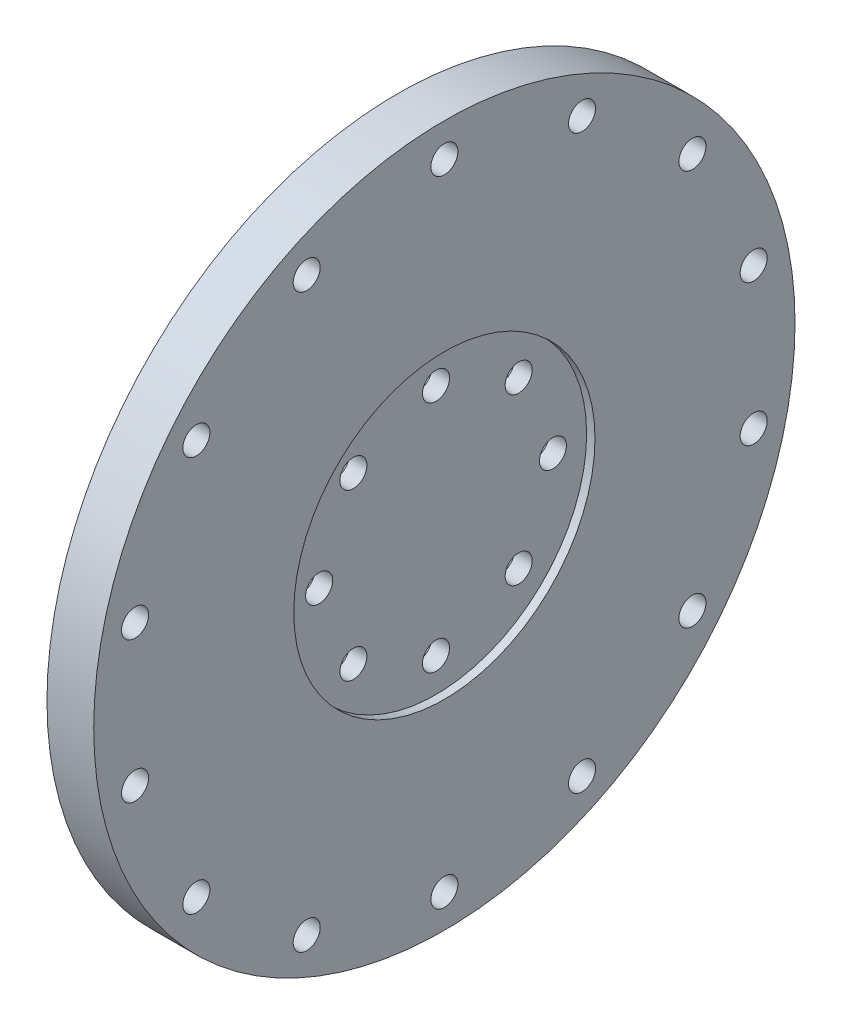
ISO-10303-21;
HEADER;
FILE_DESCRIPTION(('STEP AP214'),'2;1');
FILE_NAME('part.step','',(''),(''),'','','');
FILE_SCHEMA(('AUTOMOTIVE_DESIGN { 1 0 10303 214 1 1 1 1 }'));
ENDSEC;
DATA;
#1=APPLICATION_CONTEXT('core data for automotive mechanical design processes');
#2=APPLICATION_PROTOCOL_DEFINITION('international standard','automotive_design',2000,#1);
#3=PRODUCT_CONTEXT('',#1,'mechanical');
#4=PRODUCT('Part','Part','',(#3));
#5=PRODUCT_RELATED_PRODUCT_CATEGORY('part','',(#4));
#6=PRODUCT_DEFINITION_FORMATION('','',#4);
#7=PRODUCT_DEFINITION_CONTEXT('part definition',#1,'design');
#8=PRODUCT_DEFINITION('design','',#6,#7);
#9=PRODUCT_DEFINITION_SHAPE('','',#8);
#10=(LENGTH_UNIT() NAMED_UNIT(*) SI_UNIT(.MILLI.,.METRE.));
#11=(NAMED_UNIT(*) PLANE_ANGLE_UNIT() SI_UNIT($,.RADIAN.));
#12=(NAMED_UNIT(*) SI_UNIT($,.STERADIAN.) SOLID_ANGLE_UNIT());
#13=UNCERTAINTY_MEASURE_WITH_UNIT(LENGTH_MEASURE(1.E-05),#10,'distance_accuracy_value','');
#14=(GEOMETRIC_REPRESENTATION_CONTEXT(3) GLOBAL_UNCERTAINTY_ASSIGNED_CONTEXT((#13)) GLOBAL_UNIT_ASSIGNED_CONTEXT((#10,
#11,#12)) REPRESENTATION_CONTEXT('',''));
#15=CARTESIAN_POINT('',(0.,0.,0.));
#16=DIRECTION('',(0.,0.,1.));
#17=DIRECTION('',(1.,0.,0.));
#18=AXIS2_PLACEMENT_3D('',#15,#16,#17);
#19=CARTESIAN_POINT('',(-0.4,0.,17.5));
#20=DIRECTION('',(-1.,0.,0.));
#21=DIRECTION('',(0.,0.,1.));
#22=AXIS2_PLACEMENT_3D('',#19,#20,#21);
#23=CONICAL_SURFACE('',#22,2.025,0.785398163397448);
#24=CARTESIAN_POINT('',(-3.5,0.,17.5));
#25=DIRECTION('',(1.,0.,0.));
#26=DIRECTION('',(0.,0.,-1.));
#27=AXIS2_PLACEMENT_3D('',#24,#25,#26);
#28=CIRCLE('',#27,5.125);
#29=CARTESIAN_POINT('',(-3.5,0.,12.375));
#30=VERTEX_POINT('',#29);
#31=EDGE_CURVE('E196',#30,#30,#28,.T.);
#32=ORIENTED_EDGE('',*,*,#31,.F.);
#33=EDGE_LOOP('',(#32));
#34=FACE_BOUND('',#33,.T.);
#35=CARTESIAN_POINT('',(-0.4,0.,17.5));
#36=DIRECTION('',(1.,0.,0.));
#37=DIRECTION('',(0.,0.,-1.));
#38=AXIS2_PLACEMENT_3D('',#35,#36,#37);
#39=CIRCLE('',#38,2.025);
#40=CARTESIAN_POINT('',(-0.4,0.,15.475));
#41=VERTEX_POINT('',#40);
#42=EDGE_CURVE('E275',#41,#41,#39,.T.);
#43=ORIENTED_EDGE('',*,*,#42,.T.);
#44=EDGE_LOOP('',(#43));
#45=FACE_BOUND('',#44,.T.);
#46=ADVANCED_FACE('F16',(#34,#45),#23,.F.);
#47=CARTESIAN_POINT('',(-0.4,-12.3743686707646,12.3743686707646));
#48=DIRECTION('',(-1.,0.,0.));
#49=DIRECTION('',(0.,0.,1.));
#50=AXIS2_PLACEMENT_3D('',#47,#48,#49);
#51=CONICAL_SURFACE('',#50,2.025,0.785398163397448);
#52=CARTESIAN_POINT('',(-3.5,-12.3743686707646,12.3743686707646));
#53=DIRECTION('',(1.,0.,0.));
#54=DIRECTION('',(0.,0.,-1.));
#55=AXIS2_PLACEMENT_3D('',#52,#53,#54);
#56=CIRCLE('',#55,5.125);
#57=CARTESIAN_POINT('',(-3.5,-12.3743686707646,7.24936867076458));
#58=VERTEX_POINT('',#57);
#59=EDGE_CURVE('E270',#58,#58,#56,.T.);
#60=ORIENTED_EDGE('',*,*,#59,.F.);
#61=EDGE_LOOP('',(#60));
#62=FACE_BOUND('',#61,.T.);
#63=CARTESIAN_POINT('',(-0.4,-12.3743686707646,12.3743686707646));
#64=DIRECTION('',(1.,0.,0.));
#65=DIRECTION('',(0.,0.,-1.));
#66=AXIS2_PLACEMENT_3D('',#63,#64,#65);
#67=CIRCLE('',#66,2.025);
#68=CARTESIAN_POINT('',(-0.4,-12.3743686707646,10.3493686707646));
#69=VERTEX_POINT('',#68);
#70=EDGE_CURVE('E578',#69,#69,#67,.T.);
#71=ORIENTED_EDGE('',*,*,#70,.T.);
#72=EDGE_LOOP('',(#71));
#73=FACE_BOUND('',#72,.T.);
#74=ADVANCED_FACE('F386',(#62,#73),#51,.F.);
#75=CARTESIAN_POINT('',(-0.4,-17.5,0.));
#76=DIRECTION('',(-1.,0.,0.));
#77=DIRECTION('',(0.,0.,1.));
#78=AXIS2_PLACEMENT_3D('',#75,#76,#77);
#79=CONICAL_SURFACE('',#78,2.025,0.785398163397448);
#80=CARTESIAN_POINT('',(-3.5,-17.5,0.));
#81=DIRECTION('',(1.,0.,0.));
#82=DIRECTION('',(0.,0.,-1.));
#83=AXIS2_PLACEMENT_3D('',#80,#81,#82);
#84=CIRCLE('',#83,5.125);
#85=CARTESIAN_POINT('',(-3.5,-17.5,-5.125));
#86=VERTEX_POINT('',#85);
#87=EDGE_CURVE('E284',#86,#86,#84,.T.);
#88=ORIENTED_EDGE('',*,*,#87,.F.);
#89=EDGE_LOOP('',(#88));
#90=FACE_BOUND('',#89,.T.);
#91=CARTESIAN_POINT('',(-0.4,-17.5,0.));
#92=DIRECTION('',(1.,0.,0.));
#93=DIRECTION('',(0.,0.,-1.));
#94=AXIS2_PLACEMENT_3D('',#91,#92,#93);
#95=CIRCLE('',#94,2.025);
#96=CARTESIAN_POINT('',(-0.4,-17.5,-2.025));
#97=VERTEX_POINT('',#96);
#98=EDGE_CURVE('E563',#97,#97,#95,.T.);
#99=ORIENTED_EDGE('',*,*,#98,.T.);
#100=EDGE_LOOP('',(#99));
#101=FACE_BOUND('',#100,.T.);
#102=ADVANCED_FACE('F391',(#90,#101),#79,.F.);
#103=CARTESIAN_POINT('',(-0.4,-12.3743686707646,-12.3743686707646));
#104=DIRECTION('',(-1.,0.,0.));
#105=DIRECTION('',(0.,0.,1.));
#106=AXIS2_PLACEMENT_3D('',#103,#104,#105);
#107=CONICAL_SURFACE('',#106,2.025,0.785398163397448);
#108=CARTESIAN_POINT('',(-3.5,-12.3743686707646,-12.3743686707646));
#109=DIRECTION('',(1.,0.,0.));
#110=DIRECTION('',(0.,0.,-1.));
#111=AXIS2_PLACEMENT_3D('',#108,#109,#110);
#112=CIRCLE('',#111,5.125);
#113=CARTESIAN_POINT('',(-3.5,-12.3743686707646,-17.4993686707646));
#114=VERTEX_POINT('',#113);
#115=EDGE_CURVE('E288',#114,#114,#112,.T.);
#116=ORIENTED_EDGE('',*,*,#115,.F.);
#117=EDGE_LOOP('',(#116));
#118=FACE_BOUND('',#117,.T.);
#119=CARTESIAN_POINT('',(-0.4,-12.3743686707646,-12.3743686707646));
#120=DIRECTION('',(1.,0.,0.));
#121=DIRECTION('',(0.,0.,-1.));
#122=AXIS2_PLACEMENT_3D('',#119,#120,#121);
#123=CIRCLE('',#122,2.025);
#124=CARTESIAN_POINT('',(-0.4,-12.3743686707646,-14.3993686707646));
#125=VERTEX_POINT('',#124);
#126=EDGE_CURVE('E235',#125,#125,#123,.T.);
#127=ORIENTED_EDGE('',*,*,#126,.T.);
#128=EDGE_LOOP('',(#127));
#129=FACE_BOUND('',#128,.T.);
#130=ADVANCED_FACE('F540',(#118,#129),#107,.F.);
#131=CARTESIAN_POINT('',(-0.4,0.,-17.5));
#132=DIRECTION('',(-1.,0.,0.));
#133=DIRECTION('',(0.,0.,1.));
#134=AXIS2_PLACEMENT_3D('',#131,#132,#133);
#135=CONICAL_SURFACE('',#134,2.025,0.785398163397448);
#136=CARTESIAN_POINT('',(-3.5,0.,-17.5));
#137=DIRECTION('',(1.,0.,0.));
#138=DIRECTION('',(0.,0.,-1.));
#139=AXIS2_PLACEMENT_3D('',#136,#137,#138);
#140=CIRCLE('',#139,5.125);
#141=CARTESIAN_POINT('',(-3.5,0.,-22.625));
#142=VERTEX_POINT('',#141);
#143=EDGE_CURVE('E208',#142,#142,#140,.T.);
#144=ORIENTED_EDGE('',*,*,#143,.F.);
#145=EDGE_LOOP('',(#144));
#146=FACE_BOUND('',#145,.T.);
#147=CARTESIAN_POINT('',(-0.4,0.,-17.5));
#148=DIRECTION('',(1.,0.,0.));
#149=DIRECTION('',(0.,0.,-1.));
#150=AXIS2_PLACEMENT_3D('',#147,#148,#149);
#151=CIRCLE('',#150,2.025);
#152=CARTESIAN_POINT('',(-0.4,0.,-19.525));
#153=VERTEX_POINT('',#152);
#154=EDGE_CURVE('E250',#153,#153,#151,.T.);
#155=ORIENTED_EDGE('',*,*,#154,.T.);
#156=EDGE_LOOP('',(#155));
#157=FACE_BOUND('',#156,.T.);
#158=ADVANCED_FACE('F537',(#146,#157),#135,.F.);
#159=CARTESIAN_POINT('',(-0.4,12.3743686707646,-12.3743686707646));
#160=DIRECTION('',(-1.,0.,0.));
#161=DIRECTION('',(0.,0.,1.));
#162=AXIS2_PLACEMENT_3D('',#159,#160,#161);
#163=CONICAL_SURFACE('',#162,2.025,0.785398163397448);
#164=CARTESIAN_POINT('',(-3.5,12.3743686707646,-12.3743686707646));
#165=DIRECTION('',(1.,0.,0.));
#166=DIRECTION('',(0.,0.,-1.));
#167=AXIS2_PLACEMENT_3D('',#164,#165,#166);
#168=CIRCLE('',#167,5.125);
#169=CARTESIAN_POINT('',(-3.5,12.3743686707646,-17.4993686707646));
#170=VERTEX_POINT('',#169);
#171=EDGE_CURVE('E203',#170,#170,#168,.T.);
#172=ORIENTED_EDGE('',*,*,#171,.F.);
#173=EDGE_LOOP('',(#172));
#174=FACE_BOUND('',#173,.T.);
#175=CARTESIAN_POINT('',(-0.4,12.3743686707646,-12.3743686707646));
#176=DIRECTION('',(1.,0.,0.));
#177=DIRECTION('',(0.,0.,-1.));
#178=AXIS2_PLACEMENT_3D('',#175,#176,#177);
#179=CIRCLE('',#178,2.025);
#180=CARTESIAN_POINT('',(-0.4,12.3743686707646,-14.3993686707646));
#181=VERTEX_POINT('',#180);
#182=EDGE_CURVE('E249',#181,#181,#179,.T.);
#183=ORIENTED_EDGE('',*,*,#182,.T.);
#184=EDGE_LOOP('',(#183));
#185=FACE_BOUND('',#184,.T.);
#186=ADVANCED_FACE('F401',(#174,#185),#163,.F.);
#187=CARTESIAN_POINT('',(-0.4,12.3743686707646,12.3743686707646));
#188=DIRECTION('',(-1.,0.,0.));
#189=DIRECTION('',(0.,0.,1.));
#190=AXIS2_PLACEMENT_3D('',#187,#188,#189);
#191=CONICAL_SURFACE('',#190,2.025,0.785398163397448);
#192=CARTESIAN_POINT('',(-3.5,12.3743686707646,12.3743686707646));
#193=DIRECTION('',(1.,0.,0.));
#194=DIRECTION('',(0.,0.,-1.));
#195=AXIS2_PLACEMENT_3D('',#192,#193,#194);
#196=CIRCLE('',#195,5.125);
#197=CARTESIAN_POINT('',(-3.5,12.3743686707646,7.24936867076458));
#198=VERTEX_POINT('',#197);
#199=EDGE_CURVE('E207',#198,#198,#196,.T.);
#200=ORIENTED_EDGE('',*,*,#199,.F.);
#201=EDGE_LOOP('',(#200));
#202=FACE_BOUND('',#201,.T.);
#203=CARTESIAN_POINT('',(-0.4,12.3743686707646,12.3743686707646));
#204=DIRECTION('',(1.,0.,0.));
#205=DIRECTION('',(0.,0.,-1.));
#206=AXIS2_PLACEMENT_3D('',#203,#204,#205);
#207=CIRCLE('',#206,2.025);
#208=CARTESIAN_POINT('',(-0.4,12.3743686707646,10.3493686707646));
#209=VERTEX_POINT('',#208);
#210=EDGE_CURVE('E317',#209,#209,#207,.T.);
#211=ORIENTED_EDGE('',*,*,#210,.T.);
#212=EDGE_LOOP('',(#211));
#213=FACE_BOUND('',#212,.T.);
#214=ADVANCED_FACE('F397',(#202,#213),#191,.F.);
#215=CARTESIAN_POINT('',(-0.4,17.5,0.));
#216=DIRECTION('',(-1.,0.,0.));
#217=DIRECTION('',(0.,0.,1.));
#218=AXIS2_PLACEMENT_3D('',#215,#216,#217);
#219=CONICAL_SURFACE('',#218,2.025,0.785398163397448);
#220=CARTESIAN_POINT('',(-3.5,17.5,0.));
#221=DIRECTION('',(1.,0.,0.));
#222=DIRECTION('',(0.,0.,-1.));
#223=AXIS2_PLACEMENT_3D('',#220,#221,#222);
#224=CIRCLE('',#223,5.125);
#225=CARTESIAN_POINT('',(-3.5,17.5,-5.125));
#226=VERTEX_POINT('',#225);
#227=EDGE_CURVE('E27',#226,#226,#224,.T.);
#228=ORIENTED_EDGE('',*,*,#227,.F.);
#229=EDGE_LOOP('',(#228));
#230=FACE_BOUND('',#229,.T.);
#231=CARTESIAN_POINT('',(-0.4,17.5,0.));
#232=DIRECTION('',(1.,0.,0.));
#233=DIRECTION('',(0.,0.,-1.));
#234=AXIS2_PLACEMENT_3D('',#231,#232,#233);
#235=CIRCLE('',#234,2.025);
#236=CARTESIAN_POINT('',(-0.4,17.5,-2.025));
#237=VERTEX_POINT('',#236);
#238=EDGE_CURVE('E276',#237,#237,#235,.T.);
#239=ORIENTED_EDGE('',*,*,#238,.T.);
#240=EDGE_LOOP('',(#239));
#241=FACE_BOUND('',#240,.T.);
#242=ADVANCED_FACE('F382',(#230,#241),#219,.F.);
#243=CARTESIAN_POINT('',(2.25,0.,0.));
#244=DIRECTION('',(1.,0.,0.));
#245=DIRECTION('',(0.,1.,0.));
#246=AXIS2_PLACEMENT_3D('',#243,#244,#245);
#247=PLANE('',#246);
#248=CARTESIAN_POINT('',(2.25,0.,0.));
#249=DIRECTION('',(1.,0.,0.));
#250=DIRECTION('',(0.,0.,-1.));
#251=AXIS2_PLACEMENT_3D('',#248,#249,#250);
#252=CIRCLE('',#251,22.55);
#253=CARTESIAN_POINT('',(2.25,0.,-22.55));
#254=VERTEX_POINT('',#253);
#255=EDGE_CURVE('E11',#254,#254,#252,.T.);
#256=ORIENTED_EDGE('',*,*,#255,.T.);
#257=EDGE_LOOP('',(#256));
#258=FACE_BOUND('',#257,.T.);
#259=CARTESIAN_POINT('',(2.25,0.,17.5));
#260=DIRECTION('',(1.,0.,0.));
#261=DIRECTION('',(0.,0.,-1.));
#262=AXIS2_PLACEMENT_3D('',#259,#260,#261);
#263=CIRCLE('',#262,2.025);
#264=CARTESIAN_POINT('',(2.25,0.,15.475));
#265=VERTEX_POINT('',#264);
#266=EDGE_CURVE('E322',#265,#265,#263,.T.);
#267=ORIENTED_EDGE('',*,*,#266,.F.);
#268=EDGE_LOOP('',(#267));
#269=FACE_BOUND('',#268,.T.);
#270=CARTESIAN_POINT('',(2.25,-12.3743686707646,12.3743686707646));
#271=DIRECTION('',(1.,0.,0.));
#272=DIRECTION('',(0.,0.,-1.));
#273=AXIS2_PLACEMENT_3D('',#270,#271,#272);
#274=CIRCLE('',#273,2.025);
#275=CARTESIAN_POINT('',(2.25,-12.3743686707646,10.3493686707646));
#276=VERTEX_POINT('',#275);
#277=EDGE_CURVE('E421',#276,#276,#274,.T.);
#278=ORIENTED_EDGE('',*,*,#277,.F.);
#279=EDGE_LOOP('',(#278));
#280=FACE_BOUND('',#279,.T.);
#281=CARTESIAN_POINT('',(2.25,-17.5,0.));
#282=DIRECTION('',(1.,0.,0.));
#283=DIRECTION('',(0.,0.,-1.));
#284=AXIS2_PLACEMENT_3D('',#281,#282,#283);
#285=CIRCLE('',#284,2.025);
#286=CARTESIAN_POINT('',(2.25,-17.5,-2.025));
#287=VERTEX_POINT('',#286);
#288=EDGE_CURVE('E560',#287,#287,#285,.T.);
#289=ORIENTED_EDGE('',*,*,#288,.F.);
#290=EDGE_LOOP('',(#289));
#291=FACE_BOUND('',#290,.T.);
#292=CARTESIAN_POINT('',(2.25,-12.3743686707646,-12.3743686707646));
#293=DIRECTION('',(1.,0.,0.));
#294=DIRECTION('',(0.,0.,-1.));
#295=AXIS2_PLACEMENT_3D('',#292,#293,#294);
#296=CIRCLE('',#295,2.025);
#297=CARTESIAN_POINT('',(2.25,-12.3743686707646,-14.3993686707646));
#298=VERTEX_POINT('',#297);
#299=EDGE_CURVE('E260',#298,#298,#296,.T.);
#300=ORIENTED_EDGE('',*,*,#299,.F.);
#301=EDGE_LOOP('',(#300));
#302=FACE_BOUND('',#301,.T.);
#303=CARTESIAN_POINT('',(2.25,0.,-17.5));
#304=DIRECTION('',(1.,0.,0.));
#305=DIRECTION('',(0.,0.,-1.));
#306=AXIS2_PLACEMENT_3D('',#303,#304,#305);
#307=CIRCLE('',#306,2.025);
#308=CARTESIAN_POINT('',(2.25,0.,-19.525));
#309=VERTEX_POINT('',#308);
#310=EDGE_CURVE('E246',#309,#309,#307,.T.);
#311=ORIENTED_EDGE('',*,*,#310,.F.);
#312=EDGE_LOOP('',(#311));
#313=FACE_BOUND('',#312,.T.);
#314=CARTESIAN_POINT('',(2.25,12.3743686707646,-12.3743686707646));
#315=DIRECTION('',(1.,0.,0.));
#316=DIRECTION('',(0.,0.,-1.));
#317=AXIS2_PLACEMENT_3D('',#314,#315,#316);
#318=CIRCLE('',#317,2.025);
#319=CARTESIAN_POINT('',(2.25,12.3743686707646,-14.3993686707646));
#320=VERTEX_POINT('',#319);
#321=EDGE_CURVE('E258',#320,#320,#318,.T.);
#322=ORIENTED_EDGE('',*,*,#321,.F.);
#323=EDGE_LOOP('',(#322));
#324=FACE_BOUND('',#323,.T.);
#325=CARTESIAN_POINT('',(2.25,12.3743686707646,12.3743686707646));
#326=DIRECTION('',(1.,0.,0.));
#327=DIRECTION('',(0.,0.,-1.));
#328=AXIS2_PLACEMENT_3D('',#325,#326,#327);
#329=CIRCLE('',#328,2.025);
#330=CARTESIAN_POINT('',(2.25,12.3743686707646,10.3493686707646));
#331=VERTEX_POINT('',#330);
#332=EDGE_CURVE('E413',#331,#331,#329,.T.);
#333=ORIENTED_EDGE('',*,*,#332,.F.);
#334=EDGE_LOOP('',(#333));
#335=FACE_BOUND('',#334,.T.);
#336=CARTESIAN_POINT('',(2.25,17.5,0.));
#337=DIRECTION('',(1.,0.,0.));
#338=DIRECTION('',(0.,0.,-1.));
#339=AXIS2_PLACEMENT_3D('',#336,#337,#338);
#340=CIRCLE('',#339,2.025);
#341=CARTESIAN_POINT('',(2.25,17.5,-2.025));
#342=VERTEX_POINT('',#341);
#343=EDGE_CURVE('E272',#342,#342,#340,.T.);
#344=ORIENTED_EDGE('',*,*,#343,.F.);
#345=EDGE_LOOP('',(#344));
#346=FACE_BOUND('',#345,.T.);
#347=ADVANCED_FACE('F374',(#258,#269,#280,#291,#302,#313,#324,#335,#346),#247,.T.);
#348=CARTESIAN_POINT('',(2.25,0.,0.));
#349=DIRECTION('',(1.,0.,0.));
#350=DIRECTION('',(0.,0.,-1.));
#351=AXIS2_PLACEMENT_3D('',#348,#349,#350);
#352=CYLINDRICAL_SURFACE('',#351,22.55);
#353=CARTESIAN_POINT('',(3.5,0.,0.));
#354=DIRECTION('',(1.,0.,0.));
#355=DIRECTION('',(0.,0.,-1.));
#356=AXIS2_PLACEMENT_3D('',#353,#354,#355);
#357=CIRCLE('',#356,22.55);
#358=CARTESIAN_POINT('',(3.5,0.,-22.55));
#359=VERTEX_POINT('',#358);
#360=EDGE_CURVE('E289',#359,#359,#357,.T.);
#361=ORIENTED_EDGE('',*,*,#360,.T.);
#362=EDGE_LOOP('',(#361));
#363=FACE_BOUND('',#362,.T.);
#364=ORIENTED_EDGE('',*,*,#255,.F.);
#365=EDGE_LOOP('',(#364));
#366=FACE_BOUND('',#365,.T.);
#367=ADVANCED_FACE('F371',(#363,#366),#352,.F.);
#368=CARTESIAN_POINT('',(-3.5,0.,0.));
#369=DIRECTION('',(1.,0.,0.));
#370=DIRECTION('',(0.,1.,0.));
#371=AXIS2_PLACEMENT_3D('',#368,#369,#370);
#372=PLANE('',#371);
#373=CARTESIAN_POINT('',(-3.5,0.,0.));
#374=DIRECTION('',(1.,0.,0.));
#375=DIRECTION('',(0.,0.,-1.));
#376=AXIS2_PLACEMENT_3D('',#373,#374,#375);
#377=CIRCLE('',#376,52.5);
#378=CARTESIAN_POINT('',(-3.5,0.,-52.5));
#379=VERTEX_POINT('',#378);
#380=EDGE_CURVE('E428',#379,#379,#377,.T.);
#381=ORIENTED_EDGE('',*,*,#380,.F.);
#382=EDGE_LOOP('',(#381));
#383=FACE_BOUND('',#382,.T.);
#384=CARTESIAN_POINT('',(-3.5,-10.5697443629249,46.3090758286366));
#385=DIRECTION('',(1.,0.,0.));
#386=DIRECTION('',(0.,0.,-1.));
#387=AXIS2_PLACEMENT_3D('',#384,#385,#386);
#388=CIRCLE('',#387,2.025);
#389=CARTESIAN_POINT('',(-3.5,-10.5697443629249,44.2840758286366));
#390=VERTEX_POINT('',#389);
#391=EDGE_CURVE('E300',#390,#390,#388,.T.);
#392=ORIENTED_EDGE('',*,*,#391,.T.);
#393=EDGE_LOOP('',(#392));
#394=FACE_BOUND('',#393,.T.);
#395=CARTESIAN_POINT('',(-3.5,-29.6157655882898,37.1369954172314));
#396=DIRECTION('',(1.,0.,0.));
#397=DIRECTION('',(0.,0.,-1.));
#398=AXIS2_PLACEMENT_3D('',#395,#396,#397);
#399=CIRCLE('',#398,2.025);
#400=CARTESIAN_POINT('',(-3.5,-29.6157655882898,35.1119954172314));
#401=VERTEX_POINT('',#400);
#402=EDGE_CURVE('E198',#401,#401,#399,.T.);
#403=ORIENTED_EDGE('',*,*,#402,.T.);
#404=EDGE_LOOP('',(#403));
#405=FACE_BOUND('',#404,.T.);
#406=CARTESIAN_POINT('',(-3.5,-42.7960212253649,20.609477608084));
#407=DIRECTION('',(1.,0.,0.));
#408=DIRECTION('',(0.,0.,-1.));
#409=AXIS2_PLACEMENT_3D('',#406,#407,#408);
#410=CIRCLE('',#409,2.025);
#411=CARTESIAN_POINT('',(-3.5,-42.7960212253649,18.584477608084));
#412=VERTEX_POINT('',#411);
#413=EDGE_CURVE('E209',#412,#412,#410,.T.);
#414=ORIENTED_EDGE('',*,*,#413,.T.);
#415=EDGE_LOOP('',(#414));
#416=FACE_BOUND('',#415,.T.);
#417=CARTESIAN_POINT('',(-3.5,-47.5,0.));
#418=DIRECTION('',(1.,0.,0.));
#419=DIRECTION('',(0.,0.,-1.));
#420=AXIS2_PLACEMENT_3D('',#417,#418,#419);
#421=CIRCLE('',#420,2.025);
#422=CARTESIAN_POINT('',(-3.5,-47.5,-2.025));
#423=VERTEX_POINT('',#422);
#424=EDGE_CURVE('E311',#423,#423,#421,.T.);
#425=ORIENTED_EDGE('',*,*,#424,.T.);
#426=EDGE_LOOP('',(#425));
#427=FACE_BOUND('',#426,.T.);
#428=CARTESIAN_POINT('',(-3.5,-42.7960212253649,-20.609477608084));
#429=DIRECTION('',(1.,0.,0.));
#430=DIRECTION('',(0.,0.,-1.));
#431=AXIS2_PLACEMENT_3D('',#428,#429,#430);
#432=CIRCLE('',#431,2.025);
#433=CARTESIAN_POINT('',(-3.5,-42.7960212253649,-22.634477608084));
#434=VERTEX_POINT('',#433);
#435=EDGE_CURVE('E303',#434,#434,#432,.T.);
#436=ORIENTED_EDGE('',*,*,#435,.T.);
#437=EDGE_LOOP('',(#436));
#438=FACE_BOUND('',#437,.T.);
#439=CARTESIAN_POINT('',(-3.5,-29.6157655882898,-37.1369954172314));
#440=DIRECTION('',(1.,0.,0.));
#441=DIRECTION('',(0.,0.,-1.));
#442=AXIS2_PLACEMENT_3D('',#439,#440,#441);
#443=CIRCLE('',#442,2.025);
#444=CARTESIAN_POINT('',(-3.5,-29.6157655882898,-39.1619954172314));
#445=VERTEX_POINT('',#444);
#446=EDGE_CURVE('E20',#445,#445,#443,.T.);
#447=ORIENTED_EDGE('',*,*,#446,.T.);
#448=EDGE_LOOP('',(#447));
#449=FACE_BOUND('',#448,.T.);
#450=CARTESIAN_POINT('',(-3.5,-10.5697443629249,-46.3090758286366));
#451=DIRECTION('',(1.,0.,0.));
#452=DIRECTION('',(0.,0.,-1.));
#453=AXIS2_PLACEMENT_3D('',#450,#451,#452);
#454=CIRCLE('',#453,2.025);
#455=CARTESIAN_POINT('',(-3.5,-10.5697443629249,-48.3340758286366));
#456=VERTEX_POINT('',#455);
#457=EDGE_CURVE('E278',#456,#456,#454,.T.);
#458=ORIENTED_EDGE('',*,*,#457,.T.);
#459=EDGE_LOOP('',(#458));
#460=FACE_BOUND('',#459,.T.);
#461=CARTESIAN_POINT('',(-3.5,10.5697443629249,-46.3090758286366));
#462=DIRECTION('',(1.,0.,0.));
#463=DIRECTION('',(0.,0.,-1.));
#464=AXIS2_PLACEMENT_3D('',#461,#462,#463);
#465=CIRCLE('',#464,2.025);
#466=CARTESIAN_POINT('',(-3.5,10.5697443629249,-48.3340758286366));
#467=VERTEX_POINT('',#466);
#468=EDGE_CURVE('E241',#467,#467,#465,.T.);
#469=ORIENTED_EDGE('',*,*,#468,.T.);
#470=EDGE_LOOP('',(#469));
#471=FACE_BOUND('',#470,.T.);
#472=CARTESIAN_POINT('',(-3.5,29.6157655882898,-37.1369954172314));
#473=DIRECTION('',(1.,0.,0.));
#474=DIRECTION('',(0.,0.,-1.));
#475=AXIS2_PLACEMENT_3D('',#472,#473,#474);
#476=CIRCLE('',#475,2.025);
#477=CARTESIAN_POINT('',(-3.5,29.6157655882898,-39.1619954172314));
#478=VERTEX_POINT('',#477);
#479=EDGE_CURVE('E224',#478,#478,#476,.T.);
#480=ORIENTED_EDGE('',*,*,#479,.T.);
#481=EDGE_LOOP('',(#480));
#482=FACE_BOUND('',#481,.T.);
#483=CARTESIAN_POINT('',(-3.5,42.7960212253649,-20.609477608084));
#484=DIRECTION('',(1.,0.,0.));
#485=DIRECTION('',(0.,0.,-1.));
#486=AXIS2_PLACEMENT_3D('',#483,#484,#485);
#487=CIRCLE('',#486,2.025);
#488=CARTESIAN_POINT('',(-3.5,42.7960212253649,-22.634477608084));
#489=VERTEX_POINT('',#488);
#490=EDGE_CURVE('E213',#489,#489,#487,.T.);
#491=ORIENTED_EDGE('',*,*,#490,.T.);
#492=EDGE_LOOP('',(#491));
#493=FACE_BOUND('',#492,.T.);
#494=CARTESIAN_POINT('',(-3.5,47.5,0.));
#495=DIRECTION('',(1.,0.,0.));
#496=DIRECTION('',(0.,0.,-1.));
#497=AXIS2_PLACEMENT_3D('',#494,#495,#496);
#498=CIRCLE('',#497,2.025);
#499=CARTESIAN_POINT('',(-3.5,47.5,-2.025));
#500=VERTEX_POINT('',#499);
#501=EDGE_CURVE('E172',#500,#500,#498,.T.);
#502=ORIENTED_EDGE('',*,*,#501,.T.);
#503=EDGE_LOOP('',(#502));
#504=FACE_BOUND('',#503,.T.);
#505=CARTESIAN_POINT('',(-3.5,42.7960212253649,20.609477608084));
#506=DIRECTION('',(1.,0.,0.));
#507=DIRECTION('',(0.,0.,-1.));
#508=AXIS2_PLACEMENT_3D('',#505,#506,#507);
#509=CIRCLE('',#508,2.025);
#510=CARTESIAN_POINT('',(-3.5,42.7960212253649,18.584477608084));
#511=VERTEX_POINT('',#510);
#512=EDGE_CURVE('E182',#511,#511,#509,.T.);
#513=ORIENTED_EDGE('',*,*,#512,.T.);
#514=EDGE_LOOP('',(#513));
#515=FACE_BOUND('',#514,.T.);
#516=CARTESIAN_POINT('',(-3.5,29.6157655882898,37.1369954172314));
#517=DIRECTION('',(1.,0.,0.));
#518=DIRECTION('',(0.,0.,-1.));
#519=AXIS2_PLACEMENT_3D('',#516,#517,#518);
#520=CIRCLE('',#519,2.025);
#521=CARTESIAN_POINT('',(-3.5,29.6157655882898,35.1119954172314));
#522=VERTEX_POINT('',#521);
#523=EDGE_CURVE('E245',#522,#522,#520,.T.);
#524=ORIENTED_EDGE('',*,*,#523,.T.);
#525=EDGE_LOOP('',(#524));
#526=FACE_BOUND('',#525,.T.);
#527=CARTESIAN_POINT('',(-3.5,10.5697443629249,46.3090758286366));
#528=DIRECTION('',(1.,0.,0.));
#529=DIRECTION('',(0.,0.,-1.));
#530=AXIS2_PLACEMENT_3D('',#527,#528,#529);
#531=CIRCLE('',#530,2.025);
#532=CARTESIAN_POINT('',(-3.5,10.5697443629249,44.2840758286366));
#533=VERTEX_POINT('',#532);
#534=EDGE_CURVE('E244',#533,#533,#531,.T.);
#535=ORIENTED_EDGE('',*,*,#534,.T.);
#536=EDGE_LOOP('',(#535));
#537=FACE_BOUND('',#536,.T.);
#538=ORIENTED_EDGE('',*,*,#227,.T.);
#539=EDGE_LOOP('',(#538));
#540=FACE_BOUND('',#539,.T.);
#541=ORIENTED_EDGE('',*,*,#199,.T.);
#542=EDGE_LOOP('',(#541));
#543=FACE_BOUND('',#542,.T.);
#544=ORIENTED_EDGE('',*,*,#171,.T.);
#545=EDGE_LOOP('',(#544));
#546=FACE_BOUND('',#545,.T.);
#547=ORIENTED_EDGE('',*,*,#143,.T.);
#548=EDGE_LOOP('',(#547));
#549=FACE_BOUND('',#548,.T.);
#550=ORIENTED_EDGE('',*,*,#115,.T.);
#551=EDGE_LOOP('',(#550));
#552=FACE_BOUND('',#551,.T.);
#553=ORIENTED_EDGE('',*,*,#87,.T.);
#554=EDGE_LOOP('',(#553));
#555=FACE_BOUND('',#554,.T.);
#556=ORIENTED_EDGE('',*,*,#59,.T.);
#557=EDGE_LOOP('',(#556));
#558=FACE_BOUND('',#557,.T.);
#559=ORIENTED_EDGE('',*,*,#31,.T.);
#560=EDGE_LOOP('',(#559));
#561=FACE_BOUND('',#560,.T.);
#562=ADVANCED_FACE('F331',(#383,#394,#405,#416,#427,#438,#449,#460,#471,#482,#493,#504,#515,
#526,#537,#540,#543,#546,#549,#552,#555,#558,#561),#372,.F.);
#563=CARTESIAN_POINT('',(3.5,0.,0.));
#564=DIRECTION('',(1.,0.,0.));
#565=DIRECTION('',(0.,1.,0.));
#566=AXIS2_PLACEMENT_3D('',#563,#564,#565);
#567=PLANE('',#566);
#568=CARTESIAN_POINT('',(3.5,0.,0.));
#569=DIRECTION('',(1.,0.,0.));
#570=DIRECTION('',(0.,0.,-1.));
#571=AXIS2_PLACEMENT_3D('',#568,#569,#570);
#572=CIRCLE('',#571,52.5);
#573=CARTESIAN_POINT('',(3.5,0.,-52.5));
#574=VERTEX_POINT('',#573);
#575=EDGE_CURVE('E324',#574,#574,#572,.T.);
#576=ORIENTED_EDGE('',*,*,#575,.T.);
#577=EDGE_LOOP('',(#576));
#578=FACE_BOUND('',#577,.T.);
#579=CARTESIAN_POINT('',(3.5,-10.5697443629249,46.3090758286366));
#580=DIRECTION('',(1.,0.,0.));
#581=DIRECTION('',(0.,0.,-1.));
#582=AXIS2_PLACEMENT_3D('',#579,#580,#581);
#583=CIRCLE('',#582,2.025);
#584=CARTESIAN_POINT('',(3.5,-10.5697443629249,44.2840758286366));
#585=VERTEX_POINT('',#584);
#586=EDGE_CURVE('E426',#585,#585,#583,.T.);
#587=ORIENTED_EDGE('',*,*,#586,.F.);
#588=EDGE_LOOP('',(#587));
#589=FACE_BOUND('',#588,.T.);
#590=CARTESIAN_POINT('',(3.5,-29.6157655882898,37.1369954172314));
#591=DIRECTION('',(1.,0.,0.));
#592=DIRECTION('',(0.,0.,-1.));
#593=AXIS2_PLACEMENT_3D('',#590,#591,#592);
#594=CIRCLE('',#593,2.025);
#595=CARTESIAN_POINT('',(3.5,-29.6157655882898,35.1119954172314));
#596=VERTEX_POINT('',#595);
#597=EDGE_CURVE('E202',#596,#596,#594,.T.);
#598=ORIENTED_EDGE('',*,*,#597,.F.);
#599=EDGE_LOOP('',(#598));
#600=FACE_BOUND('',#599,.T.);
#601=CARTESIAN_POINT('',(3.5,-42.7960212253649,20.609477608084));
#602=DIRECTION('',(1.,0.,0.));
#603=DIRECTION('',(0.,0.,-1.));
#604=AXIS2_PLACEMENT_3D('',#601,#602,#603);
#605=CIRCLE('',#604,2.025);
#606=CARTESIAN_POINT('',(3.5,-42.7960212253649,18.584477608084));
#607=VERTEX_POINT('',#606);
#608=EDGE_CURVE('E201',#607,#607,#605,.T.);
#609=ORIENTED_EDGE('',*,*,#608,.F.);
#610=EDGE_LOOP('',(#609));
#611=FACE_BOUND('',#610,.T.);
#612=CARTESIAN_POINT('',(3.5,-47.5,0.));
#613=DIRECTION('',(1.,0.,0.));
#614=DIRECTION('',(0.,0.,-1.));
#615=AXIS2_PLACEMENT_3D('',#612,#613,#614);
#616=CIRCLE('',#615,2.025);
#617=CARTESIAN_POINT('',(3.5,-47.5,-2.025));
#618=VERTEX_POINT('',#617);
#619=EDGE_CURVE('E212',#618,#618,#616,.T.);
#620=ORIENTED_EDGE('',*,*,#619,.F.);
#621=EDGE_LOOP('',(#620));
#622=FACE_BOUND('',#621,.T.);
#623=CARTESIAN_POINT('',(3.5,-42.7960212253649,-20.609477608084));
#624=DIRECTION('',(1.,0.,0.));
#625=DIRECTION('',(0.,0.,-1.));
#626=AXIS2_PLACEMENT_3D('',#623,#624,#625);
#627=CIRCLE('',#626,2.025);
#628=CARTESIAN_POINT('',(3.5,-42.7960212253649,-22.634477608084));
#629=VERTEX_POINT('',#628);
#630=EDGE_CURVE('E307',#629,#629,#627,.T.);
#631=ORIENTED_EDGE('',*,*,#630,.F.);
#632=EDGE_LOOP('',(#631));
#633=FACE_BOUND('',#632,.T.);
#634=CARTESIAN_POINT('',(3.5,-29.6157655882898,-37.1369954172314));
#635=DIRECTION('',(1.,0.,0.));
#636=DIRECTION('',(0.,0.,-1.));
#637=AXIS2_PLACEMENT_3D('',#634,#635,#636);
#638=CIRCLE('',#637,2.025);
#639=CARTESIAN_POINT('',(3.5,-29.6157655882898,-39.1619954172314));
#640=VERTEX_POINT('',#639);
#641=EDGE_CURVE('E301',#640,#640,#638,.T.);
#642=ORIENTED_EDGE('',*,*,#641,.F.);
#643=EDGE_LOOP('',(#642));
#644=FACE_BOUND('',#643,.T.);
#645=CARTESIAN_POINT('',(3.5,-10.5697443629249,-46.3090758286366));
#646=DIRECTION('',(1.,0.,0.));
#647=DIRECTION('',(0.,0.,-1.));
#648=AXIS2_PLACEMENT_3D('',#645,#646,#647);
#649=CIRCLE('',#648,2.025);
#650=CARTESIAN_POINT('',(3.5,-10.5697443629249,-48.3340758286366));
#651=VERTEX_POINT('',#650);
#652=EDGE_CURVE('E283',#651,#651,#649,.T.);
#653=ORIENTED_EDGE('',*,*,#652,.F.);
#654=EDGE_LOOP('',(#653));
#655=FACE_BOUND('',#654,.T.);
#656=CARTESIAN_POINT('',(3.5,10.5697443629249,-46.3090758286366));
#657=DIRECTION('',(1.,0.,0.));
#658=DIRECTION('',(0.,0.,-1.));
#659=AXIS2_PLACEMENT_3D('',#656,#657,#658);
#660=CIRCLE('',#659,2.025);
#661=CARTESIAN_POINT('',(3.5,10.5697443629249,-48.3340758286366));
#662=VERTEX_POINT('',#661);
#663=EDGE_CURVE('E282',#662,#662,#660,.T.);
#664=ORIENTED_EDGE('',*,*,#663,.F.);
#665=EDGE_LOOP('',(#664));
#666=FACE_BOUND('',#665,.T.);
#667=CARTESIAN_POINT('',(3.5,29.6157655882898,-37.1369954172314));
#668=DIRECTION('',(1.,0.,0.));
#669=DIRECTION('',(0.,0.,-1.));
#670=AXIS2_PLACEMENT_3D('',#667,#668,#669);
#671=CIRCLE('',#670,2.025);
#672=CARTESIAN_POINT('',(3.5,29.6157655882898,-39.1619954172314));
#673=VERTEX_POINT('',#672);
#674=EDGE_CURVE('E232',#673,#673,#671,.T.);
#675=ORIENTED_EDGE('',*,*,#674,.F.);
#676=EDGE_LOOP('',(#675));
#677=FACE_BOUND('',#676,.T.);
#678=CARTESIAN_POINT('',(3.5,42.7960212253649,-20.609477608084));
#679=DIRECTION('',(1.,0.,0.));
#680=DIRECTION('',(0.,0.,-1.));
#681=AXIS2_PLACEMENT_3D('',#678,#679,#680);
#682=CIRCLE('',#681,2.025);
#683=CARTESIAN_POINT('',(3.5,42.7960212253649,-22.634477608084));
#684=VERTEX_POINT('',#683);
#685=EDGE_CURVE('E215',#684,#684,#682,.T.);
#686=ORIENTED_EDGE('',*,*,#685,.F.);
#687=EDGE_LOOP('',(#686));
#688=FACE_BOUND('',#687,.T.);
#689=CARTESIAN_POINT('',(3.5,47.5,0.));
#690=DIRECTION('',(1.,0.,0.));
#691=DIRECTION('',(0.,0.,-1.));
#692=AXIS2_PLACEMENT_3D('',#689,#690,#691);
#693=CIRCLE('',#692,2.025);
#694=CARTESIAN_POINT('',(3.5,47.5,-2.025));
#695=VERTEX_POINT('',#694);
#696=EDGE_CURVE('E192',#695,#695,#693,.T.);
#697=ORIENTED_EDGE('',*,*,#696,.F.);
#698=EDGE_LOOP('',(#697));
#699=FACE_BOUND('',#698,.T.);
#700=CARTESIAN_POINT('',(3.5,42.7960212253649,20.609477608084));
#701=DIRECTION('',(1.,0.,0.));
#702=DIRECTION('',(0.,0.,-1.));
#703=AXIS2_PLACEMENT_3D('',#700,#701,#702);
#704=CIRCLE('',#703,2.025);
#705=CARTESIAN_POINT('',(3.5,42.7960212253649,18.584477608084));
#706=VERTEX_POINT('',#705);
#707=EDGE_CURVE('E178',#706,#706,#704,.T.);
#708=ORIENTED_EDGE('',*,*,#707,.F.);
#709=EDGE_LOOP('',(#708));
#710=FACE_BOUND('',#709,.T.);
#711=CARTESIAN_POINT('',(3.5,29.6157655882898,37.1369954172314));
#712=DIRECTION('',(1.,0.,0.));
#713=DIRECTION('',(0.,0.,-1.));
#714=AXIS2_PLACEMENT_3D('',#711,#712,#713);
#715=CIRCLE('',#714,2.025);
#716=CARTESIAN_POINT('',(3.5,29.6157655882898,35.1119954172314));
#717=VERTEX_POINT('',#716);
#718=EDGE_CURVE('E189',#717,#717,#715,.T.);
#719=ORIENTED_EDGE('',*,*,#718,.F.);
#720=EDGE_LOOP('',(#719));
#721=FACE_BOUND('',#720,.T.);
#722=CARTESIAN_POINT('',(3.5,10.5697443629249,46.3090758286366));
#723=DIRECTION('',(1.,0.,0.));
#724=DIRECTION('',(0.,0.,-1.));
#725=AXIS2_PLACEMENT_3D('',#722,#723,#724);
#726=CIRCLE('',#725,2.025);
#727=CARTESIAN_POINT('',(3.5,10.5697443629249,44.2840758286366));
#728=VERTEX_POINT('',#727);
#729=EDGE_CURVE('E242',#728,#728,#726,.T.);
#730=ORIENTED_EDGE('',*,*,#729,.F.);
#731=EDGE_LOOP('',(#730));
#732=FACE_BOUND('',#731,.T.);
#733=ORIENTED_EDGE('',*,*,#360,.F.);
#734=EDGE_LOOP('',(#733));
#735=FACE_BOUND('',#734,.T.);
#736=ADVANCED_FACE('F344',(#578,#589,#600,#611,#622,#633,#644,#655,#666,#677,#688,#699,#710,
#721,#732,#735),#567,.T.);
#737=CARTESIAN_POINT('',(3.5,10.5697443629249,46.3090758286366));
#738=DIRECTION('',(-1.,0.,0.));
#739=DIRECTION('',(0.,0.,1.));
#740=AXIS2_PLACEMENT_3D('',#737,#738,#739);
#741=CYLINDRICAL_SURFACE('',#740,2.025);
#742=ORIENTED_EDGE('',*,*,#534,.F.);
#743=EDGE_LOOP('',(#742));
#744=FACE_BOUND('',#743,.T.);
#745=ORIENTED_EDGE('',*,*,#729,.T.);
#746=EDGE_LOOP('',(#745));
#747=FACE_BOUND('',#746,.T.);
#748=ADVANCED_FACE('F347',(#744,#747),#741,.F.);
#749=CARTESIAN_POINT('',(3.5,29.6157655882898,37.1369954172314));
#750=DIRECTION('',(-1.,0.,0.));
#751=DIRECTION('',(0.,0.,1.));
#752=AXIS2_PLACEMENT_3D('',#749,#750,#751);
#753=CYLINDRICAL_SURFACE('',#752,2.025);
#754=ORIENTED_EDGE('',*,*,#523,.F.);
#755=EDGE_LOOP('',(#754));
#756=FACE_BOUND('',#755,.T.);
#757=ORIENTED_EDGE('',*,*,#718,.T.);
#758=EDGE_LOOP('',(#757));
#759=FACE_BOUND('',#758,.T.);
#760=ADVANCED_FACE('F518',(#756,#759),#753,.F.);
#761=CARTESIAN_POINT('',(3.5,42.7960212253649,20.609477608084));
#762=DIRECTION('',(-1.,0.,0.));
#763=DIRECTION('',(0.,0.,1.));
#764=AXIS2_PLACEMENT_3D('',#761,#762,#763);
#765=CYLINDRICAL_SURFACE('',#764,2.025);
#766=ORIENTED_EDGE('',*,*,#512,.F.);
#767=EDGE_LOOP('',(#766));
#768=FACE_BOUND('',#767,.T.);
#769=ORIENTED_EDGE('',*,*,#707,.T.);
#770=EDGE_LOOP('',(#769));
#771=FACE_BOUND('',#770,.T.);
#772=ADVANCED_FACE('F179',(#768,#771),#765,.F.);
#773=CARTESIAN_POINT('',(3.5,47.5,0.));
#774=DIRECTION('',(-1.,0.,0.));
#775=DIRECTION('',(0.,0.,1.));
#776=AXIS2_PLACEMENT_3D('',#773,#774,#775);
#777=CYLINDRICAL_SURFACE('',#776,2.025);
#778=ORIENTED_EDGE('',*,*,#501,.F.);
#779=EDGE_LOOP('',(#778));
#780=FACE_BOUND('',#779,.T.);
#781=ORIENTED_EDGE('',*,*,#696,.T.);
#782=EDGE_LOOP('',(#781));
#783=FACE_BOUND('',#782,.T.);
#784=ADVANCED_FACE('F713',(#780,#783),#777,.F.);
#785=CARTESIAN_POINT('',(3.5,42.7960212253649,-20.609477608084));
#786=DIRECTION('',(-1.,0.,0.));
#787=DIRECTION('',(0.,0.,1.));
#788=AXIS2_PLACEMENT_3D('',#785,#786,#787);
#789=CYLINDRICAL_SURFACE('',#788,2.025);
#790=ORIENTED_EDGE('',*,*,#490,.F.);
#791=EDGE_LOOP('',(#790));
#792=FACE_BOUND('',#791,.T.);
#793=ORIENTED_EDGE('',*,*,#685,.T.);
#794=EDGE_LOOP('',(#793));
#795=FACE_BOUND('',#794,.T.);
#796=ADVANCED_FACE('F510',(#792,#795),#789,.F.);
#797=CARTESIAN_POINT('',(3.5,29.6157655882898,-37.1369954172314));
#798=DIRECTION('',(-1.,0.,0.));
#799=DIRECTION('',(0.,0.,1.));
#800=AXIS2_PLACEMENT_3D('',#797,#798,#799);
#801=CYLINDRICAL_SURFACE('',#800,2.025);
#802=ORIENTED_EDGE('',*,*,#479,.F.);
#803=EDGE_LOOP('',(#802));
#804=FACE_BOUND('',#803,.T.);
#805=ORIENTED_EDGE('',*,*,#674,.T.);
#806=EDGE_LOOP('',(#805));
#807=FACE_BOUND('',#806,.T.);
#808=ADVANCED_FACE('F502',(#804,#807),#801,.F.);
#809=CARTESIAN_POINT('',(3.5,10.5697443629249,-46.3090758286366));
#810=DIRECTION('',(-1.,0.,0.));
#811=DIRECTION('',(0.,0.,1.));
#812=AXIS2_PLACEMENT_3D('',#809,#810,#811);
#813=CYLINDRICAL_SURFACE('',#812,2.025);
#814=ORIENTED_EDGE('',*,*,#468,.F.);
#815=EDGE_LOOP('',(#814));
#816=FACE_BOUND('',#815,.T.);
#817=ORIENTED_EDGE('',*,*,#663,.T.);
#818=EDGE_LOOP('',(#817));
#819=FACE_BOUND('',#818,.T.);
#820=ADVANCED_FACE('F499',(#816,#819),#813,.F.);
#821=CARTESIAN_POINT('',(3.5,-10.5697443629249,-46.3090758286366));
#822=DIRECTION('',(-1.,0.,0.));
#823=DIRECTION('',(0.,0.,1.));
#824=AXIS2_PLACEMENT_3D('',#821,#822,#823);
#825=CYLINDRICAL_SURFACE('',#824,2.025);
#826=ORIENTED_EDGE('',*,*,#457,.F.);
#827=EDGE_LOOP('',(#826));
#828=FACE_BOUND('',#827,.T.);
#829=ORIENTED_EDGE('',*,*,#652,.T.);
#830=EDGE_LOOP('',(#829));
#831=FACE_BOUND('',#830,.T.);
#832=ADVANCED_FACE('F501',(#828,#831),#825,.F.);
#833=CARTESIAN_POINT('',(3.5,-29.6157655882898,-37.1369954172314));
#834=DIRECTION('',(-1.,0.,0.));
#835=DIRECTION('',(0.,0.,1.));
#836=AXIS2_PLACEMENT_3D('',#833,#834,#835);
#837=CYLINDRICAL_SURFACE('',#836,2.025);
#838=ORIENTED_EDGE('',*,*,#446,.F.);
#839=EDGE_LOOP('',(#838));
#840=FACE_BOUND('',#839,.T.);
#841=ORIENTED_EDGE('',*,*,#641,.T.);
#842=EDGE_LOOP('',(#841));
#843=FACE_BOUND('',#842,.T.);
#844=ADVANCED_FACE('F338',(#840,#843),#837,.F.);
#845=CARTESIAN_POINT('',(3.5,-42.7960212253649,-20.609477608084));
#846=DIRECTION('',(-1.,0.,0.));
#847=DIRECTION('',(0.,0.,1.));
#848=AXIS2_PLACEMENT_3D('',#845,#846,#847);
#849=CYLINDRICAL_SURFACE('',#848,2.025);
#850=ORIENTED_EDGE('',*,*,#435,.F.);
#851=EDGE_LOOP('',(#850));
#852=FACE_BOUND('',#851,.T.);
#853=ORIENTED_EDGE('',*,*,#630,.T.);
#854=EDGE_LOOP('',(#853));
#855=FACE_BOUND('',#854,.T.);
#856=ADVANCED_FACE('F334',(#852,#855),#849,.F.);
#857=CARTESIAN_POINT('',(3.5,-47.5,0.));
#858=DIRECTION('',(-1.,0.,0.));
#859=DIRECTION('',(0.,0.,1.));
#860=AXIS2_PLACEMENT_3D('',#857,#858,#859);
#861=CYLINDRICAL_SURFACE('',#860,2.025);
#862=ORIENTED_EDGE('',*,*,#424,.F.);
#863=EDGE_LOOP('',(#862));
#864=FACE_BOUND('',#863,.T.);
#865=ORIENTED_EDGE('',*,*,#619,.T.);
#866=EDGE_LOOP('',(#865));
#867=FACE_BOUND('',#866,.T.);
#868=ADVANCED_FACE('F337',(#864,#867),#861,.F.);
#869=CARTESIAN_POINT('',(3.5,-42.7960212253649,20.609477608084));
#870=DIRECTION('',(-1.,0.,0.));
#871=DIRECTION('',(0.,0.,1.));
#872=AXIS2_PLACEMENT_3D('',#869,#870,#871);
#873=CYLINDRICAL_SURFACE('',#872,2.025);
#874=ORIENTED_EDGE('',*,*,#413,.F.);
#875=EDGE_LOOP('',(#874));
#876=FACE_BOUND('',#875,.T.);
#877=ORIENTED_EDGE('',*,*,#608,.T.);
#878=EDGE_LOOP('',(#877));
#879=FACE_BOUND('',#878,.T.);
#880=ADVANCED_FACE('F525',(#876,#879),#873,.F.);
#881=CARTESIAN_POINT('',(3.5,-29.6157655882898,37.1369954172314));
#882=DIRECTION('',(-1.,0.,0.));
#883=DIRECTION('',(0.,0.,1.));
#884=AXIS2_PLACEMENT_3D('',#881,#882,#883);
#885=CYLINDRICAL_SURFACE('',#884,2.025);
#886=ORIENTED_EDGE('',*,*,#402,.F.);
#887=EDGE_LOOP('',(#886));
#888=FACE_BOUND('',#887,.T.);
#889=ORIENTED_EDGE('',*,*,#597,.T.);
#890=EDGE_LOOP('',(#889));
#891=FACE_BOUND('',#890,.T.);
#892=ADVANCED_FACE('F598',(#888,#891),#885,.F.);
#893=CARTESIAN_POINT('',(3.5,-10.5697443629249,46.3090758286366));
#894=DIRECTION('',(-1.,0.,0.));
#895=DIRECTION('',(0.,0.,1.));
#896=AXIS2_PLACEMENT_3D('',#893,#894,#895);
#897=CYLINDRICAL_SURFACE('',#896,2.025);
#898=ORIENTED_EDGE('',*,*,#391,.F.);
#899=EDGE_LOOP('',(#898));
#900=FACE_BOUND('',#899,.T.);
#901=ORIENTED_EDGE('',*,*,#586,.T.);
#902=EDGE_LOOP('',(#901));
#903=FACE_BOUND('',#902,.T.);
#904=ADVANCED_FACE('F596',(#900,#903),#897,.F.);
#905=CARTESIAN_POINT('',(3.5,0.,0.));
#906=DIRECTION('',(-1.,0.,0.));
#907=DIRECTION('',(0.,0.,1.));
#908=AXIS2_PLACEMENT_3D('',#905,#906,#907);
#909=CYLINDRICAL_SURFACE('',#908,52.5);
#910=ORIENTED_EDGE('',*,*,#380,.T.);
#911=EDGE_LOOP('',(#910));
#912=FACE_BOUND('',#911,.T.);
#913=ORIENTED_EDGE('',*,*,#575,.F.);
#914=EDGE_LOOP('',(#913));
#915=FACE_BOUND('',#914,.T.);
#916=ADVANCED_FACE('F521',(#912,#915),#909,.T.);
#917=CARTESIAN_POINT('',(3.5,0.,17.5));
#918=DIRECTION('',(-1.,0.,0.));
#919=DIRECTION('',(0.,0.,1.));
#920=AXIS2_PLACEMENT_3D('',#917,#918,#919);
#921=CYLINDRICAL_SURFACE('',#920,2.025);
#922=ORIENTED_EDGE('',*,*,#266,.T.);
#923=EDGE_LOOP('',(#922));
#924=FACE_BOUND('',#923,.T.);
#925=ORIENTED_EDGE('',*,*,#42,.F.);
#926=EDGE_LOOP('',(#925));
#927=FACE_BOUND('',#926,.T.);
#928=ADVANCED_FACE('F445',(#924,#927),#921,.F.);
#929=CARTESIAN_POINT('',(3.5,17.5,0.));
#930=DIRECTION('',(-1.,0.,0.));
#931=DIRECTION('',(0.,0.,1.));
#932=AXIS2_PLACEMENT_3D('',#929,#930,#931);
#933=CYLINDRICAL_SURFACE('',#932,2.025);
#934=ORIENTED_EDGE('',*,*,#343,.T.);
#935=EDGE_LOOP('',(#934));
#936=FACE_BOUND('',#935,.T.);
#937=ORIENTED_EDGE('',*,*,#238,.F.);
#938=EDGE_LOOP('',(#937));
#939=FACE_BOUND('',#938,.T.);
#940=ADVANCED_FACE('F437',(#936,#939),#933,.F.);
#941=CARTESIAN_POINT('',(3.5,12.3743686707646,12.3743686707646));
#942=DIRECTION('',(-1.,0.,0.));
#943=DIRECTION('',(0.,0.,1.));
#944=AXIS2_PLACEMENT_3D('',#941,#942,#943);
#945=CYLINDRICAL_SURFACE('',#944,2.025);
#946=ORIENTED_EDGE('',*,*,#332,.T.);
#947=EDGE_LOOP('',(#946));
#948=FACE_BOUND('',#947,.T.);
#949=ORIENTED_EDGE('',*,*,#210,.F.);
#950=EDGE_LOOP('',(#949));
#951=FACE_BOUND('',#950,.T.);
#952=ADVANCED_FACE('F18',(#948,#951),#945,.F.);
#953=CARTESIAN_POINT('',(3.5,12.3743686707646,-12.3743686707646));
#954=DIRECTION('',(-1.,0.,0.));
#955=DIRECTION('',(0.,0.,1.));
#956=AXIS2_PLACEMENT_3D('',#953,#954,#955);
#957=CYLINDRICAL_SURFACE('',#956,2.025);
#958=ORIENTED_EDGE('',*,*,#321,.T.);
#959=EDGE_LOOP('',(#958));
#960=FACE_BOUND('',#959,.T.);
#961=ORIENTED_EDGE('',*,*,#182,.F.);
#962=EDGE_LOOP('',(#961));
#963=FACE_BOUND('',#962,.T.);
#964=ADVANCED_FACE('F436',(#960,#963),#957,.F.);
#965=CARTESIAN_POINT('',(3.5,0.,-17.5));
#966=DIRECTION('',(-1.,0.,0.));
#967=DIRECTION('',(0.,0.,1.));
#968=AXIS2_PLACEMENT_3D('',#965,#966,#967);
#969=CYLINDRICAL_SURFACE('',#968,2.025);
#970=ORIENTED_EDGE('',*,*,#310,.T.);
#971=EDGE_LOOP('',(#970));
#972=FACE_BOUND('',#971,.T.);
#973=ORIENTED_EDGE('',*,*,#154,.F.);
#974=EDGE_LOOP('',(#973));
#975=FACE_BOUND('',#974,.T.);
#976=ADVANCED_FACE('F442',(#972,#975),#969,.F.);
#977=CARTESIAN_POINT('',(3.5,-12.3743686707646,-12.3743686707646));
#978=DIRECTION('',(-1.,0.,0.));
#979=DIRECTION('',(0.,0.,1.));
#980=AXIS2_PLACEMENT_3D('',#977,#978,#979);
#981=CYLINDRICAL_SURFACE('',#980,2.025);
#982=ORIENTED_EDGE('',*,*,#299,.T.);
#983=EDGE_LOOP('',(#982));
#984=FACE_BOUND('',#983,.T.);
#985=ORIENTED_EDGE('',*,*,#126,.F.);
#986=EDGE_LOOP('',(#985));
#987=FACE_BOUND('',#986,.T.);
#988=ADVANCED_FACE('F532',(#984,#987),#981,.F.);
#989=CARTESIAN_POINT('',(3.5,-17.5,0.));
#990=DIRECTION('',(-1.,0.,0.));
#991=DIRECTION('',(0.,0.,1.));
#992=AXIS2_PLACEMENT_3D('',#989,#990,#991);
#993=CYLINDRICAL_SURFACE('',#992,2.025);
#994=ORIENTED_EDGE('',*,*,#288,.T.);
#995=EDGE_LOOP('',(#994));
#996=FACE_BOUND('',#995,.T.);
#997=ORIENTED_EDGE('',*,*,#98,.F.);
#998=EDGE_LOOP('',(#997));
#999=FACE_BOUND('',#998,.T.);
#1000=ADVANCED_FACE('F528',(#996,#999),#993,.F.);
#1001=CARTESIAN_POINT('',(3.5,-12.3743686707646,12.3743686707646));
#1002=DIRECTION('',(-1.,0.,0.));
#1003=DIRECTION('',(0.,0.,1.));
#1004=AXIS2_PLACEMENT_3D('',#1001,#1002,#1003);
#1005=CYLINDRICAL_SURFACE('',#1004,2.025);
#1006=ORIENTED_EDGE('',*,*,#277,.T.);
#1007=EDGE_LOOP('',(#1006));
#1008=FACE_BOUND('',#1007,.T.);
#1009=ORIENTED_EDGE('',*,*,#70,.F.);
#1010=EDGE_LOOP('',(#1009));
#1011=FACE_BOUND('',#1010,.T.);
#1012=ADVANCED_FACE('F531',(#1008,#1011),#1005,.F.);
#1013=CLOSED_SHELL('',(#46,#74,#102,#130,#158,#186,#214,#242,#347,#367,#562,#736,#748,#760,#772,
#784,#796,#808,#820,#832,#844,#856,#868,#880,#892,#904,#916,#928,#940,#952,#964,#976,#988,#1000,#1012));
#1014=MANIFOLD_SOLID_BREP('B1',#1013);
#1015=ADVANCED_BREP_SHAPE_REPRESENTATION('',(#18,#1014),#14);
#1016=SHAPE_DEFINITION_REPRESENTATION(#9,#1015);
ENDSEC;
END-ISO-10303-21;
